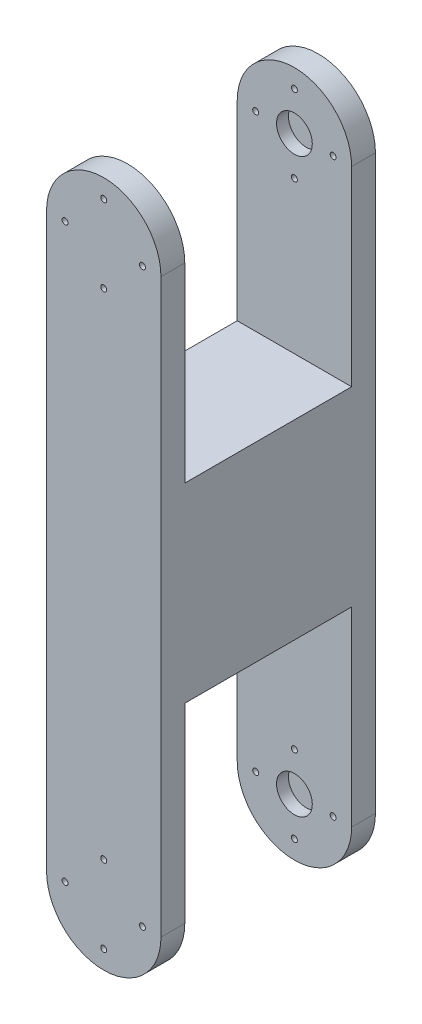
ISO-10303-21;
HEADER;
FILE_DESCRIPTION(('STEP AP214'),'2;1');
FILE_NAME('part.step','',(''),(''),'','','');
FILE_SCHEMA(('AUTOMOTIVE_DESIGN { 1 0 10303 214 1 1 1 1 }'));
ENDSEC;
DATA;
#1=APPLICATION_CONTEXT('core data for automotive mechanical design processes');
#2=APPLICATION_PROTOCOL_DEFINITION('international standard','automotive_design',2000,#1);
#3=PRODUCT_CONTEXT('',#1,'mechanical');
#4=PRODUCT('Part','Part','',(#3));
#5=PRODUCT_RELATED_PRODUCT_CATEGORY('part','',(#4));
#6=PRODUCT_DEFINITION_FORMATION('','',#4);
#7=PRODUCT_DEFINITION_CONTEXT('part definition',#1,'design');
#8=PRODUCT_DEFINITION('design','',#6,#7);
#9=PRODUCT_DEFINITION_SHAPE('','',#8);
#10=(LENGTH_UNIT() NAMED_UNIT(*) SI_UNIT(.MILLI.,.METRE.));
#11=(NAMED_UNIT(*) PLANE_ANGLE_UNIT() SI_UNIT($,.RADIAN.));
#12=(NAMED_UNIT(*) SI_UNIT($,.STERADIAN.) SOLID_ANGLE_UNIT());
#13=UNCERTAINTY_MEASURE_WITH_UNIT(LENGTH_MEASURE(1.E-05),#10,'distance_accuracy_value','');
#14=(GEOMETRIC_REPRESENTATION_CONTEXT(3) GLOBAL_UNCERTAINTY_ASSIGNED_CONTEXT((#13)) GLOBAL_UNIT_ASSIGNED_CONTEXT((#10,
#11,#12)) REPRESENTATION_CONTEXT('',''));
#15=CARTESIAN_POINT('',(0.,0.,0.));
#16=DIRECTION('',(0.,0.,1.));
#17=DIRECTION('',(1.,0.,0.));
#18=AXIS2_PLACEMENT_3D('',#15,#16,#17);
#19=CARTESIAN_POINT('',(-15.24,76.2,57.15));
#20=DIRECTION('',(1.,0.,0.));
#21=DIRECTION('',(0.,0.,-1.));
#22=AXIS2_PLACEMENT_3D('',#19,#20,#21);
#23=PLANE('',#22);
#24=DIRECTION('',(0.,1.,0.));
#25=VECTOR('',#24,1.);
#26=CARTESIAN_POINT('',(-15.24,76.2,50.8));
#27=LINE('',#26,#25);
#28=CARTESIAN_POINT('',(-15.2399999999999,-76.2,50.8));
#29=VERTEX_POINT('',#28);
#30=CARTESIAN_POINT('',(-15.24,-25.3999999999999,50.8));
#31=VERTEX_POINT('',#30);
#32=EDGE_CURVE('E156',#29,#31,#27,.T.);
#33=ORIENTED_EDGE('',*,*,#32,.F.);
#34=DIRECTION('',(0.,0.,-1.));
#35=VECTOR('',#34,1.);
#36=CARTESIAN_POINT('',(-15.24,-76.2,57.15));
#37=LINE('',#36,#35);
#38=CARTESIAN_POINT('',(-15.24,-76.2,57.15));
#39=VERTEX_POINT('',#38);
#40=EDGE_CURVE('E260',#39,#29,#37,.T.);
#41=ORIENTED_EDGE('',*,*,#40,.F.);
#42=DIRECTION('',(0.,-1.,0.));
#43=VECTOR('',#42,1.);
#44=CARTESIAN_POINT('',(-15.24,76.2,57.15));
#45=LINE('',#44,#43);
#46=CARTESIAN_POINT('',(-15.24,76.2,57.15));
#47=VERTEX_POINT('',#46);
#48=EDGE_CURVE('E235',#47,#39,#45,.T.);
#49=ORIENTED_EDGE('',*,*,#48,.F.);
#50=DIRECTION('',(0.,0.,-1.));
#51=VECTOR('',#50,1.);
#52=CARTESIAN_POINT('',(-15.24,76.2,57.15));
#53=LINE('',#52,#51);
#54=CARTESIAN_POINT('',(-15.24,76.2,50.8));
#55=VERTEX_POINT('',#54);
#56=EDGE_CURVE('E264',#47,#55,#53,.T.);
#57=ORIENTED_EDGE('',*,*,#56,.T.);
#58=DIRECTION('',(0.,-1.,0.));
#59=VECTOR('',#58,1.);
#60=CARTESIAN_POINT('',(-15.24,76.2,50.8));
#61=LINE('',#60,#59);
#62=CARTESIAN_POINT('',(-15.24,25.3999999999999,50.8));
#63=VERTEX_POINT('',#62);
#64=EDGE_CURVE('E226',#55,#63,#61,.T.);
#65=ORIENTED_EDGE('',*,*,#64,.T.);
#66=DIRECTION('',(0.,0.,-1.));
#67=VECTOR('',#66,1.);
#68=CARTESIAN_POINT('',(-15.24,25.3999999999999,57.15));
#69=LINE('',#68,#67);
#70=CARTESIAN_POINT('',(-15.24,25.3999999999999,6.34999999999999));
#71=VERTEX_POINT('',#70);
#72=EDGE_CURVE('E217',#63,#71,#69,.T.);
#73=ORIENTED_EDGE('',*,*,#72,.T.);
#74=DIRECTION('',(0.,1.,0.));
#75=VECTOR('',#74,1.);
#76=CARTESIAN_POINT('',(-15.24,76.2,6.35));
#77=LINE('',#76,#75);
#78=CARTESIAN_POINT('',(-15.24,76.2,6.35));
#79=VERTEX_POINT('',#78);
#80=EDGE_CURVE('E221',#71,#79,#77,.T.);
#81=ORIENTED_EDGE('',*,*,#80,.T.);
#82=CARTESIAN_POINT('',(-15.24,76.2,0.));
#83=VERTEX_POINT('',#82);
#84=EDGE_CURVE('E263',#79,#83,#53,.T.);
#85=ORIENTED_EDGE('',*,*,#84,.T.);
#86=DIRECTION('',(0.,-1.,0.));
#87=VECTOR('',#86,1.);
#88=CARTESIAN_POINT('',(-15.24,76.2,0.));
#89=LINE('',#88,#87);
#90=CARTESIAN_POINT('',(-15.24,-76.2,0.));
#91=VERTEX_POINT('',#90);
#92=EDGE_CURVE('E245',#83,#91,#89,.T.);
#93=ORIENTED_EDGE('',*,*,#92,.T.);
#94=CARTESIAN_POINT('',(-15.2399999999999,-76.2,6.35));
#95=VERTEX_POINT('',#94);
#96=EDGE_CURVE('E259',#95,#91,#37,.T.);
#97=ORIENTED_EDGE('',*,*,#96,.F.);
#98=DIRECTION('',(0.,-1.,0.));
#99=VECTOR('',#98,1.);
#100=CARTESIAN_POINT('',(-15.24,76.2,6.34999999999998));
#101=LINE('',#100,#99);
#102=CARTESIAN_POINT('',(-15.24,-25.3999999999999,6.34999999999999));
#103=VERTEX_POINT('',#102);
#104=EDGE_CURVE('E151',#103,#95,#101,.T.);
#105=ORIENTED_EDGE('',*,*,#104,.F.);
#106=DIRECTION('',(0.,0.,-1.));
#107=VECTOR('',#106,1.);
#108=CARTESIAN_POINT('',(-15.24,-25.3999999999999,57.15));
#109=LINE('',#108,#107);
#110=EDGE_CURVE('E134',#31,#103,#109,.T.);
#111=ORIENTED_EDGE('',*,*,#110,.F.);
#112=EDGE_LOOP('',(#33,#41,#49,#57,#65,#73,#81,#85,#93,#97,#105,#111));
#113=FACE_BOUND('',#112,.T.);
#114=ADVANCED_FACE('F34',(#113),#23,.F.);
#115=CARTESIAN_POINT('',(0.,-76.2,57.15));
#116=DIRECTION('',(0.,0.,-1.));
#117=DIRECTION('',(-1.,0.,0.));
#118=AXIS2_PLACEMENT_3D('',#115,#116,#117);
#119=CYLINDRICAL_SURFACE('',#118,15.2399999999999);
#120=CARTESIAN_POINT('',(0.,-76.2,50.8));
#121=DIRECTION('',(0.,0.,-1.));
#122=DIRECTION('',(0.,1.,0.));
#123=AXIS2_PLACEMENT_3D('',#120,#121,#122);
#124=CIRCLE('',#123,15.2399999999999);
#125=CARTESIAN_POINT('',(15.2399999999999,-76.2,50.8));
#126=VERTEX_POINT('',#125);
#127=EDGE_CURVE('E154',#126,#29,#124,.T.);
#128=ORIENTED_EDGE('',*,*,#127,.F.);
#129=DIRECTION('',(0.,0.,-1.));
#130=VECTOR('',#129,1.);
#131=CARTESIAN_POINT('',(15.24,-76.2,57.15));
#132=LINE('',#131,#130);
#133=CARTESIAN_POINT('',(15.24,-76.2,57.15));
#134=VERTEX_POINT('',#133);
#135=EDGE_CURVE('E257',#134,#126,#132,.T.);
#136=ORIENTED_EDGE('',*,*,#135,.F.);
#137=CARTESIAN_POINT('',(0.,-76.2,57.15));
#138=DIRECTION('',(0.,0.,1.));
#139=DIRECTION('',(1.,0.,0.));
#140=AXIS2_PLACEMENT_3D('',#137,#138,#139);
#141=CIRCLE('',#140,15.2399999999999);
#142=EDGE_CURVE('E238',#39,#134,#141,.T.);
#143=ORIENTED_EDGE('',*,*,#142,.F.);
#144=ORIENTED_EDGE('',*,*,#40,.T.);
#145=EDGE_LOOP('',(#128,#136,#143,#144));
#146=FACE_BOUND('',#145,.T.);
#147=ADVANCED_FACE('F324',(#146),#119,.T.);
#148=CARTESIAN_POINT('',(15.24,-76.2,6.34999999999999));
#149=VERTEX_POINT('',#148);
#150=CARTESIAN_POINT('',(15.24,-76.2,0.));
#151=VERTEX_POINT('',#150);
#152=EDGE_CURVE('E256',#149,#151,#132,.T.);
#153=ORIENTED_EDGE('',*,*,#152,.F.);
#154=CARTESIAN_POINT('',(0.,-76.2,6.35));
#155=DIRECTION('',(0.,0.,1.));
#156=DIRECTION('',(0.,-1.,0.));
#157=AXIS2_PLACEMENT_3D('',#154,#155,#156);
#158=CIRCLE('',#157,15.2399999999999);
#159=EDGE_CURVE('E51',#95,#149,#158,.T.);
#160=ORIENTED_EDGE('',*,*,#159,.F.);
#161=ORIENTED_EDGE('',*,*,#96,.T.);
#162=CARTESIAN_POINT('',(0.,-76.2,0.));
#163=DIRECTION('',(0.,0.,1.));
#164=DIRECTION('',(1.,0.,0.));
#165=AXIS2_PLACEMENT_3D('',#162,#163,#164);
#166=CIRCLE('',#165,15.2399999999999);
#167=EDGE_CURVE('E248',#91,#151,#166,.T.);
#168=ORIENTED_EDGE('',*,*,#167,.T.);
#169=EDGE_LOOP('',(#153,#160,#161,#168));
#170=FACE_BOUND('',#169,.T.);
#171=ADVANCED_FACE('F329',(#170),#119,.T.);
#172=CARTESIAN_POINT('',(15.2399999999999,76.2,57.15));
#173=DIRECTION('',(-1.,0.,0.));
#174=DIRECTION('',(0.,-1.,0.));
#175=AXIS2_PLACEMENT_3D('',#172,#173,#174);
#176=PLANE('',#175);
#177=DIRECTION('',(0.,-1.,0.));
#178=VECTOR('',#177,1.);
#179=CARTESIAN_POINT('',(15.2399999999999,76.2,50.8));
#180=LINE('',#179,#178);
#181=CARTESIAN_POINT('',(15.2399999999999,-25.3999999999999,50.8));
#182=VERTEX_POINT('',#181);
#183=EDGE_CURVE('E11',#182,#126,#180,.T.);
#184=ORIENTED_EDGE('',*,*,#183,.F.);
#185=DIRECTION('',(0.,0.,-1.));
#186=VECTOR('',#185,1.);
#187=CARTESIAN_POINT('',(15.2399999999999,-25.3999999999999,50.8));
#188=LINE('',#187,#186);
#189=CARTESIAN_POINT('',(15.2399999999999,-25.3999999999999,6.34999999999999));
#190=VERTEX_POINT('',#189);
#191=EDGE_CURVE('E131',#182,#190,#188,.T.);
#192=ORIENTED_EDGE('',*,*,#191,.T.);
#193=DIRECTION('',(0.,-1.,0.));
#194=VECTOR('',#193,1.);
#195=CARTESIAN_POINT('',(15.2399999999999,-91.4399999999999,6.35));
#196=LINE('',#195,#194);
#197=EDGE_CURVE('E138',#190,#149,#196,.T.);
#198=ORIENTED_EDGE('',*,*,#197,.T.);
#199=ORIENTED_EDGE('',*,*,#152,.T.);
#200=DIRECTION('',(0.,1.,0.));
#201=VECTOR('',#200,1.);
#202=CARTESIAN_POINT('',(15.2399999999999,76.2,0.));
#203=LINE('',#202,#201);
#204=CARTESIAN_POINT('',(15.2399999999999,76.2,0.));
#205=VERTEX_POINT('',#204);
#206=EDGE_CURVE('E236',#151,#205,#203,.T.);
#207=ORIENTED_EDGE('',*,*,#206,.T.);
#208=DIRECTION('',(0.,0.,-1.));
#209=VECTOR('',#208,1.);
#210=CARTESIAN_POINT('',(15.2399999999999,76.2,57.15));
#211=LINE('',#210,#209);
#212=CARTESIAN_POINT('',(15.2399999999999,76.2,6.35));
#213=VERTEX_POINT('',#212);
#214=EDGE_CURVE('E242',#213,#205,#211,.T.);
#215=ORIENTED_EDGE('',*,*,#214,.F.);
#216=DIRECTION('',(0.,1.,0.));
#217=VECTOR('',#216,1.);
#218=CARTESIAN_POINT('',(15.2399999999999,91.4399999999999,6.35));
#219=LINE('',#218,#217);
#220=CARTESIAN_POINT('',(15.2399999999999,25.3999999999999,6.34999999999999));
#221=VERTEX_POINT('',#220);
#222=EDGE_CURVE('E212',#221,#213,#219,.T.);
#223=ORIENTED_EDGE('',*,*,#222,.F.);
#224=DIRECTION('',(0.,0.,-1.));
#225=VECTOR('',#224,1.);
#226=CARTESIAN_POINT('',(15.2399999999999,25.3999999999999,50.8));
#227=LINE('',#226,#225);
#228=CARTESIAN_POINT('',(15.2399999999999,25.3999999999999,50.8));
#229=VERTEX_POINT('',#228);
#230=EDGE_CURVE('E208',#229,#221,#227,.T.);
#231=ORIENTED_EDGE('',*,*,#230,.F.);
#232=DIRECTION('',(0.,1.,0.));
#233=VECTOR('',#232,1.);
#234=CARTESIAN_POINT('',(15.2399999999999,76.2,50.8));
#235=LINE('',#234,#233);
#236=CARTESIAN_POINT('',(15.2399999999999,76.2,50.8));
#237=VERTEX_POINT('',#236);
#238=EDGE_CURVE('E43',#229,#237,#235,.T.);
#239=ORIENTED_EDGE('',*,*,#238,.T.);
#240=CARTESIAN_POINT('',(15.2399999999999,76.2,57.15));
#241=VERTEX_POINT('',#240);
#242=EDGE_CURVE('E253',#241,#237,#211,.T.);
#243=ORIENTED_EDGE('',*,*,#242,.F.);
#244=DIRECTION('',(0.,1.,0.));
#245=VECTOR('',#244,1.);
#246=CARTESIAN_POINT('',(15.2399999999999,76.2,57.15));
#247=LINE('',#246,#245);
#248=EDGE_CURVE('E240',#134,#241,#247,.T.);
#249=ORIENTED_EDGE('',*,*,#248,.F.);
#250=ORIENTED_EDGE('',*,*,#135,.T.);
#251=EDGE_LOOP('',(#184,#192,#198,#199,#207,#215,#223,#231,#239,#243,#249,#250));
#252=FACE_BOUND('',#251,.T.);
#253=ADVANCED_FACE('F144',(#252),#176,.F.);
#254=CARTESIAN_POINT('',(0.,76.2,57.15));
#255=DIRECTION('',(0.,0.,-1.));
#256=DIRECTION('',(-1.,0.,0.));
#257=AXIS2_PLACEMENT_3D('',#254,#255,#256);
#258=CYLINDRICAL_SURFACE('',#257,15.2399999999999);
#259=ORIENTED_EDGE('',*,*,#242,.T.);
#260=CARTESIAN_POINT('',(0.,76.2,50.8));
#261=DIRECTION('',(0.,0.,1.));
#262=DIRECTION('',(0.,-1.,0.));
#263=AXIS2_PLACEMENT_3D('',#260,#261,#262);
#264=CIRCLE('',#263,15.2399999999999);
#265=EDGE_CURVE('E229',#237,#55,#264,.T.);
#266=ORIENTED_EDGE('',*,*,#265,.T.);
#267=ORIENTED_EDGE('',*,*,#56,.F.);
#268=CARTESIAN_POINT('',(0.,76.2,57.15));
#269=DIRECTION('',(0.,0.,1.));
#270=DIRECTION('',(-1.,0.,0.));
#271=AXIS2_PLACEMENT_3D('',#268,#269,#270);
#272=CIRCLE('',#271,15.2399999999999);
#273=EDGE_CURVE('E232',#241,#47,#272,.T.);
#274=ORIENTED_EDGE('',*,*,#273,.F.);
#275=EDGE_LOOP('',(#259,#266,#267,#274));
#276=FACE_BOUND('',#275,.T.);
#277=ADVANCED_FACE('F336',(#276),#258,.T.);
#278=CARTESIAN_POINT('',(0.,76.2,6.35));
#279=DIRECTION('',(0.,0.,-1.));
#280=DIRECTION('',(0.,1.,0.));
#281=AXIS2_PLACEMENT_3D('',#278,#279,#280);
#282=CIRCLE('',#281,15.2399999999999);
#283=EDGE_CURVE('E224',#79,#213,#282,.T.);
#284=ORIENTED_EDGE('',*,*,#283,.T.);
#285=ORIENTED_EDGE('',*,*,#214,.T.);
#286=CARTESIAN_POINT('',(0.,76.2,0.));
#287=DIRECTION('',(0.,0.,1.));
#288=DIRECTION('',(-1.,0.,0.));
#289=AXIS2_PLACEMENT_3D('',#286,#287,#288);
#290=CIRCLE('',#289,15.2399999999999);
#291=EDGE_CURVE('E231',#205,#83,#290,.T.);
#292=ORIENTED_EDGE('',*,*,#291,.T.);
#293=ORIENTED_EDGE('',*,*,#84,.F.);
#294=EDGE_LOOP('',(#284,#285,#292,#293));
#295=FACE_BOUND('',#294,.T.);
#296=ADVANCED_FACE('F36',(#295),#258,.T.);
#297=CARTESIAN_POINT('',(0.,76.2,57.15));
#298=DIRECTION('',(0.,0.,-1.));
#299=DIRECTION('',(-1.,0.,0.));
#300=AXIS2_PLACEMENT_3D('',#297,#298,#299);
#301=PLANE('',#300);
#302=CARTESIAN_POINT('',(0.,-65.88125,57.15));
#303=DIRECTION('',(0.,0.,1.));
#304=DIRECTION('',(-1.,0.,0.));
#305=AXIS2_PLACEMENT_3D('',#302,#303,#304);
#306=CIRCLE('',#305,0.793749999999999);
#307=CARTESIAN_POINT('',(-0.793749999999999,-65.88125,57.15));
#308=VERTEX_POINT('',#307);
#309=EDGE_CURVE('E281',#308,#308,#306,.T.);
#310=ORIENTED_EDGE('',*,*,#309,.F.);
#311=EDGE_LOOP('',(#310));
#312=FACE_BOUND('',#311,.T.);
#313=CARTESIAN_POINT('',(10.31875,-76.2,57.15));
#314=DIRECTION('',(0.,0.,1.));
#315=DIRECTION('',(-1.,0.,0.));
#316=AXIS2_PLACEMENT_3D('',#313,#314,#315);
#317=CIRCLE('',#316,0.793749999999993);
#318=CARTESIAN_POINT('',(9.52500000000001,-76.2,57.15));
#319=VERTEX_POINT('',#318);
#320=EDGE_CURVE('E500',#319,#319,#317,.T.);
#321=ORIENTED_EDGE('',*,*,#320,.F.);
#322=EDGE_LOOP('',(#321));
#323=FACE_BOUND('',#322,.T.);
#324=CARTESIAN_POINT('',(0.,-86.51875,57.15));
#325=DIRECTION('',(0.,0.,1.));
#326=DIRECTION('',(-1.,0.,0.));
#327=AXIS2_PLACEMENT_3D('',#324,#325,#326);
#328=CIRCLE('',#327,0.79375);
#329=CARTESIAN_POINT('',(-0.793749999999998,-86.51875,57.15));
#330=VERTEX_POINT('',#329);
#331=EDGE_CURVE('E508',#330,#330,#328,.T.);
#332=ORIENTED_EDGE('',*,*,#331,.F.);
#333=EDGE_LOOP('',(#332));
#334=FACE_BOUND('',#333,.T.);
#335=CARTESIAN_POINT('',(-10.31875,-76.1999999999999,57.15));
#336=DIRECTION('',(0.,0.,1.));
#337=DIRECTION('',(-1.,0.,0.));
#338=AXIS2_PLACEMENT_3D('',#335,#336,#337);
#339=CIRCLE('',#338,0.793750000000001);
#340=CARTESIAN_POINT('',(-11.1125,-76.1999999999999,57.15));
#341=VERTEX_POINT('',#340);
#342=EDGE_CURVE('E514',#341,#341,#339,.T.);
#343=ORIENTED_EDGE('',*,*,#342,.F.);
#344=EDGE_LOOP('',(#343));
#345=FACE_BOUND('',#344,.T.);
#346=CARTESIAN_POINT('',(0.,65.88125,57.15));
#347=DIRECTION('',(0.,0.,-1.));
#348=DIRECTION('',(-1.,0.,0.));
#349=AXIS2_PLACEMENT_3D('',#346,#347,#348);
#350=CIRCLE('',#349,0.793749999999999);
#351=CARTESIAN_POINT('',(-0.793749999999999,65.88125,57.15));
#352=VERTEX_POINT('',#351);
#353=EDGE_CURVE('E159',#352,#352,#350,.T.);
#354=ORIENTED_EDGE('',*,*,#353,.T.);
#355=EDGE_LOOP('',(#354));
#356=FACE_BOUND('',#355,.T.);
#357=CARTESIAN_POINT('',(10.31875,76.2,57.15));
#358=DIRECTION('',(0.,0.,-1.));
#359=DIRECTION('',(-1.,0.,0.));
#360=AXIS2_PLACEMENT_3D('',#357,#358,#359);
#361=CIRCLE('',#360,0.793749999999993);
#362=CARTESIAN_POINT('',(9.52500000000001,76.2,57.15));
#363=VERTEX_POINT('',#362);
#364=EDGE_CURVE('E166',#363,#363,#361,.T.);
#365=ORIENTED_EDGE('',*,*,#364,.T.);
#366=EDGE_LOOP('',(#365));
#367=FACE_BOUND('',#366,.T.);
#368=CARTESIAN_POINT('',(0.,86.51875,57.15));
#369=DIRECTION('',(0.,0.,-1.));
#370=DIRECTION('',(-1.,0.,0.));
#371=AXIS2_PLACEMENT_3D('',#368,#369,#370);
#372=CIRCLE('',#371,0.79375);
#373=CARTESIAN_POINT('',(-0.793749999999998,86.51875,57.15));
#374=VERTEX_POINT('',#373);
#375=EDGE_CURVE('E172',#374,#374,#372,.T.);
#376=ORIENTED_EDGE('',*,*,#375,.T.);
#377=EDGE_LOOP('',(#376));
#378=FACE_BOUND('',#377,.T.);
#379=CARTESIAN_POINT('',(-10.31875,76.1999999999999,57.15));
#380=DIRECTION('',(0.,0.,-1.));
#381=DIRECTION('',(-1.,0.,0.));
#382=AXIS2_PLACEMENT_3D('',#379,#380,#381);
#383=CIRCLE('',#382,0.793750000000001);
#384=CARTESIAN_POINT('',(-11.1125,76.1999999999999,57.15));
#385=VERTEX_POINT('',#384);
#386=EDGE_CURVE('E178',#385,#385,#383,.T.);
#387=ORIENTED_EDGE('',*,*,#386,.T.);
#388=EDGE_LOOP('',(#387));
#389=FACE_BOUND('',#388,.T.);
#390=ORIENTED_EDGE('',*,*,#273,.T.);
#391=ORIENTED_EDGE('',*,*,#48,.T.);
#392=ORIENTED_EDGE('',*,*,#142,.T.);
#393=ORIENTED_EDGE('',*,*,#248,.T.);
#394=EDGE_LOOP('',(#390,#391,#392,#393));
#395=FACE_BOUND('',#394,.T.);
#396=ADVANCED_FACE('F341',(#312,#323,#334,#345,#356,#367,#378,#389,#395),#301,.F.);
#397=CARTESIAN_POINT('',(0.,76.2,0.));
#398=DIRECTION('',(0.,0.,-1.));
#399=DIRECTION('',(-1.,0.,0.));
#400=AXIS2_PLACEMENT_3D('',#397,#398,#399);
#401=PLANE('',#400);
#402=CARTESIAN_POINT('',(0.,-65.88125,0.));
#403=DIRECTION('',(0.,0.,1.));
#404=DIRECTION('',(-1.,0.,0.));
#405=AXIS2_PLACEMENT_3D('',#402,#403,#404);
#406=CIRCLE('',#405,0.793749999999999);
#407=CARTESIAN_POINT('',(-0.793749999999999,-65.88125,0.));
#408=VERTEX_POINT('',#407);
#409=EDGE_CURVE('E497',#408,#408,#406,.T.);
#410=ORIENTED_EDGE('',*,*,#409,.T.);
#411=EDGE_LOOP('',(#410));
#412=FACE_BOUND('',#411,.T.);
#413=CARTESIAN_POINT('',(10.31875,-76.2,0.));
#414=DIRECTION('',(0.,0.,1.));
#415=DIRECTION('',(-1.,0.,0.));
#416=AXIS2_PLACEMENT_3D('',#413,#414,#415);
#417=CIRCLE('',#416,0.793749999999993);
#418=CARTESIAN_POINT('',(9.52500000000001,-76.2,0.));
#419=VERTEX_POINT('',#418);
#420=EDGE_CURVE('E505',#419,#419,#417,.T.);
#421=ORIENTED_EDGE('',*,*,#420,.T.);
#422=EDGE_LOOP('',(#421));
#423=FACE_BOUND('',#422,.T.);
#424=CARTESIAN_POINT('',(0.,-86.51875,0.));
#425=DIRECTION('',(0.,0.,1.));
#426=DIRECTION('',(-1.,0.,0.));
#427=AXIS2_PLACEMENT_3D('',#424,#425,#426);
#428=CIRCLE('',#427,0.79375);
#429=CARTESIAN_POINT('',(-0.793749999999998,-86.51875,0.));
#430=VERTEX_POINT('',#429);
#431=EDGE_CURVE('E511',#430,#430,#428,.T.);
#432=ORIENTED_EDGE('',*,*,#431,.T.);
#433=EDGE_LOOP('',(#432));
#434=FACE_BOUND('',#433,.T.);
#435=CARTESIAN_POINT('',(-10.31875,-76.1999999999999,0.));
#436=DIRECTION('',(0.,0.,1.));
#437=DIRECTION('',(-1.,0.,0.));
#438=AXIS2_PLACEMENT_3D('',#435,#436,#437);
#439=CIRCLE('',#438,0.793750000000001);
#440=CARTESIAN_POINT('',(-11.1125,-76.1999999999999,0.));
#441=VERTEX_POINT('',#440);
#442=EDGE_CURVE('E516',#441,#441,#439,.T.);
#443=ORIENTED_EDGE('',*,*,#442,.T.);
#444=EDGE_LOOP('',(#443));
#445=FACE_BOUND('',#444,.T.);
#446=CARTESIAN_POINT('',(0.,65.88125,0.));
#447=DIRECTION('',(0.,0.,-1.));
#448=DIRECTION('',(-1.,0.,0.));
#449=AXIS2_PLACEMENT_3D('',#446,#447,#448);
#450=CIRCLE('',#449,0.793749999999999);
#451=CARTESIAN_POINT('',(-0.793749999999999,65.88125,0.));
#452=VERTEX_POINT('',#451);
#453=EDGE_CURVE('E163',#452,#452,#450,.T.);
#454=ORIENTED_EDGE('',*,*,#453,.F.);
#455=EDGE_LOOP('',(#454));
#456=FACE_BOUND('',#455,.T.);
#457=CARTESIAN_POINT('',(10.31875,76.2,0.));
#458=DIRECTION('',(0.,0.,-1.));
#459=DIRECTION('',(-1.,0.,0.));
#460=AXIS2_PLACEMENT_3D('',#457,#458,#459);
#461=CIRCLE('',#460,0.793749999999993);
#462=CARTESIAN_POINT('',(9.52500000000001,76.2,0.));
#463=VERTEX_POINT('',#462);
#464=EDGE_CURVE('E169',#463,#463,#461,.T.);
#465=ORIENTED_EDGE('',*,*,#464,.F.);
#466=EDGE_LOOP('',(#465));
#467=FACE_BOUND('',#466,.T.);
#468=CARTESIAN_POINT('',(0.,86.51875,0.));
#469=DIRECTION('',(0.,0.,-1.));
#470=DIRECTION('',(-1.,0.,0.));
#471=AXIS2_PLACEMENT_3D('',#468,#469,#470);
#472=CIRCLE('',#471,0.79375);
#473=CARTESIAN_POINT('',(-0.793749999999998,86.51875,0.));
#474=VERTEX_POINT('',#473);
#475=EDGE_CURVE('E175',#474,#474,#472,.T.);
#476=ORIENTED_EDGE('',*,*,#475,.F.);
#477=EDGE_LOOP('',(#476));
#478=FACE_BOUND('',#477,.T.);
#479=CARTESIAN_POINT('',(-10.31875,76.1999999999999,0.));
#480=DIRECTION('',(0.,0.,-1.));
#481=DIRECTION('',(-1.,0.,0.));
#482=AXIS2_PLACEMENT_3D('',#479,#480,#481);
#483=CIRCLE('',#482,0.793750000000001);
#484=CARTESIAN_POINT('',(-11.1125,76.1999999999999,0.));
#485=VERTEX_POINT('',#484);
#486=EDGE_CURVE('E158',#485,#485,#483,.T.);
#487=ORIENTED_EDGE('',*,*,#486,.F.);
#488=EDGE_LOOP('',(#487));
#489=FACE_BOUND('',#488,.T.);
#490=ORIENTED_EDGE('',*,*,#291,.F.);
#491=ORIENTED_EDGE('',*,*,#206,.F.);
#492=ORIENTED_EDGE('',*,*,#167,.F.);
#493=ORIENTED_EDGE('',*,*,#92,.F.);
#494=EDGE_LOOP('',(#490,#491,#492,#493));
#495=FACE_BOUND('',#494,.T.);
#496=ADVANCED_FACE('F337',(#412,#423,#434,#445,#456,#467,#478,#489,#495),#401,.T.);
#497=CARTESIAN_POINT('',(-41.9100000000001,91.4399999999999,50.8));
#498=DIRECTION('',(0.,0.,1.));
#499=DIRECTION('',(0.,-1.,0.));
#500=AXIS2_PLACEMENT_3D('',#497,#498,#499);
#501=PLANE('',#500);
#502=CARTESIAN_POINT('',(0.,65.88125,50.8));
#503=DIRECTION('',(0.,0.,1.));
#504=DIRECTION('',(0.,-1.,0.));
#505=AXIS2_PLACEMENT_3D('',#502,#503,#504);
#506=CIRCLE('',#505,0.793749999999999);
#507=CARTESIAN_POINT('',(0.,65.0874999999999,50.8));
#508=VERTEX_POINT('',#507);
#509=EDGE_CURVE('E195',#508,#508,#506,.T.);
#510=ORIENTED_EDGE('',*,*,#509,.T.);
#511=EDGE_LOOP('',(#510));
#512=FACE_BOUND('',#511,.T.);
#513=CARTESIAN_POINT('',(10.31875,76.2,50.8));
#514=DIRECTION('',(0.,0.,1.));
#515=DIRECTION('',(0.,-1.,0.));
#516=AXIS2_PLACEMENT_3D('',#513,#514,#515);
#517=CIRCLE('',#516,0.793749999999993);
#518=CARTESIAN_POINT('',(10.31875,75.40625,50.8));
#519=VERTEX_POINT('',#518);
#520=EDGE_CURVE('E191',#519,#519,#517,.T.);
#521=ORIENTED_EDGE('',*,*,#520,.T.);
#522=EDGE_LOOP('',(#521));
#523=FACE_BOUND('',#522,.T.);
#524=CARTESIAN_POINT('',(0.,86.51875,50.8));
#525=DIRECTION('',(0.,0.,1.));
#526=DIRECTION('',(0.,-1.,0.));
#527=AXIS2_PLACEMENT_3D('',#524,#525,#526);
#528=CIRCLE('',#527,0.79375);
#529=CARTESIAN_POINT('',(0.,85.725,50.8));
#530=VERTEX_POINT('',#529);
#531=EDGE_CURVE('E187',#530,#530,#528,.T.);
#532=ORIENTED_EDGE('',*,*,#531,.T.);
#533=EDGE_LOOP('',(#532));
#534=FACE_BOUND('',#533,.T.);
#535=CARTESIAN_POINT('',(-10.31875,76.1999999999999,50.8));
#536=DIRECTION('',(0.,0.,1.));
#537=DIRECTION('',(0.,-1.,0.));
#538=AXIS2_PLACEMENT_3D('',#535,#536,#537);
#539=CIRCLE('',#538,0.793750000000001);
#540=CARTESIAN_POINT('',(-10.31875,75.40625,50.8));
#541=VERTEX_POINT('',#540);
#542=EDGE_CURVE('E183',#541,#541,#539,.T.);
#543=ORIENTED_EDGE('',*,*,#542,.T.);
#544=EDGE_LOOP('',(#543));
#545=FACE_BOUND('',#544,.T.);
#546=CARTESIAN_POINT('',(0.,76.1999999999999,50.8));
#547=DIRECTION('',(0.,0.,1.));
#548=DIRECTION('',(1.,0.,0.));
#549=AXIS2_PLACEMENT_3D('',#546,#547,#548);
#550=CIRCLE('',#549,4.7625);
#551=CARTESIAN_POINT('',(4.7625,76.1999999999999,50.8));
#552=VERTEX_POINT('',#551);
#553=EDGE_CURVE('E198',#552,#552,#550,.T.);
#554=ORIENTED_EDGE('',*,*,#553,.T.);
#555=EDGE_LOOP('',(#554));
#556=FACE_BOUND('',#555,.T.);
#557=ORIENTED_EDGE('',*,*,#238,.F.);
#558=DIRECTION('',(1.,0.,0.));
#559=VECTOR('',#558,1.);
#560=CARTESIAN_POINT('',(-41.9100000000001,25.3999999999999,50.8));
#561=LINE('',#560,#559);
#562=EDGE_CURVE('E59',#63,#229,#561,.T.);
#563=ORIENTED_EDGE('',*,*,#562,.F.);
#564=ORIENTED_EDGE('',*,*,#64,.F.);
#565=ORIENTED_EDGE('',*,*,#265,.F.);
#566=EDGE_LOOP('',(#557,#563,#564,#565));
#567=FACE_BOUND('',#566,.T.);
#568=ADVANCED_FACE('F340',(#512,#523,#534,#545,#556,#567),#501,.F.);
#569=CARTESIAN_POINT('',(-41.9100000000001,91.4399999999999,6.35));
#570=DIRECTION('',(0.,0.,-1.));
#571=DIRECTION('',(0.,1.,0.));
#572=AXIS2_PLACEMENT_3D('',#569,#570,#571);
#573=PLANE('',#572);
#574=CARTESIAN_POINT('',(0.,65.88125,6.35));
#575=DIRECTION('',(0.,0.,-1.));
#576=DIRECTION('',(0.,1.,0.));
#577=AXIS2_PLACEMENT_3D('',#574,#575,#576);
#578=CIRCLE('',#577,0.793749999999999);
#579=CARTESIAN_POINT('',(0.,66.6749999999999,6.35));
#580=VERTEX_POINT('',#579);
#581=EDGE_CURVE('E194',#580,#580,#578,.T.);
#582=ORIENTED_EDGE('',*,*,#581,.T.);
#583=EDGE_LOOP('',(#582));
#584=FACE_BOUND('',#583,.T.);
#585=CARTESIAN_POINT('',(10.31875,76.2,6.35));
#586=DIRECTION('',(0.,0.,-1.));
#587=DIRECTION('',(0.,1.,0.));
#588=AXIS2_PLACEMENT_3D('',#585,#586,#587);
#589=CIRCLE('',#588,0.793749999999993);
#590=CARTESIAN_POINT('',(10.31875,76.99375,6.35));
#591=VERTEX_POINT('',#590);
#592=EDGE_CURVE('E190',#591,#591,#589,.T.);
#593=ORIENTED_EDGE('',*,*,#592,.T.);
#594=EDGE_LOOP('',(#593));
#595=FACE_BOUND('',#594,.T.);
#596=CARTESIAN_POINT('',(0.,86.51875,6.35));
#597=DIRECTION('',(0.,0.,-1.));
#598=DIRECTION('',(0.,1.,0.));
#599=AXIS2_PLACEMENT_3D('',#596,#597,#598);
#600=CIRCLE('',#599,0.79375);
#601=CARTESIAN_POINT('',(0.,87.3125,6.35));
#602=VERTEX_POINT('',#601);
#603=EDGE_CURVE('E186',#602,#602,#600,.T.);
#604=ORIENTED_EDGE('',*,*,#603,.T.);
#605=EDGE_LOOP('',(#604));
#606=FACE_BOUND('',#605,.T.);
#607=CARTESIAN_POINT('',(-10.31875,76.1999999999999,6.35));
#608=DIRECTION('',(0.,0.,-1.));
#609=DIRECTION('',(0.,1.,0.));
#610=AXIS2_PLACEMENT_3D('',#607,#608,#609);
#611=CIRCLE('',#610,0.793750000000001);
#612=CARTESIAN_POINT('',(-10.31875,76.9937499999999,6.35));
#613=VERTEX_POINT('',#612);
#614=EDGE_CURVE('E162',#613,#613,#611,.T.);
#615=ORIENTED_EDGE('',*,*,#614,.T.);
#616=EDGE_LOOP('',(#615));
#617=FACE_BOUND('',#616,.T.);
#618=CARTESIAN_POINT('',(0.,76.1999999999999,6.34999999999999));
#619=DIRECTION('',(0.,0.,1.));
#620=DIRECTION('',(1.,0.,0.));
#621=AXIS2_PLACEMENT_3D('',#618,#619,#620);
#622=CIRCLE('',#621,4.7625);
#623=CARTESIAN_POINT('',(4.7625,76.1999999999999,6.34999999999999));
#624=VERTEX_POINT('',#623);
#625=EDGE_CURVE('E202',#624,#624,#622,.T.);
#626=ORIENTED_EDGE('',*,*,#625,.F.);
#627=EDGE_LOOP('',(#626));
#628=FACE_BOUND('',#627,.T.);
#629=ORIENTED_EDGE('',*,*,#283,.F.);
#630=ORIENTED_EDGE('',*,*,#80,.F.);
#631=DIRECTION('',(1.,0.,0.));
#632=VECTOR('',#631,1.);
#633=CARTESIAN_POINT('',(-41.9100000000001,25.3999999999999,6.34999999999999));
#634=LINE('',#633,#632);
#635=EDGE_CURVE('E215',#71,#221,#634,.T.);
#636=ORIENTED_EDGE('',*,*,#635,.T.);
#637=ORIENTED_EDGE('',*,*,#222,.T.);
#638=EDGE_LOOP('',(#629,#630,#636,#637));
#639=FACE_BOUND('',#638,.T.);
#640=ADVANCED_FACE('F348',(#584,#595,#606,#617,#628,#639),#573,.F.);
#641=CARTESIAN_POINT('',(-41.9100000000001,25.3999999999999,50.8));
#642=DIRECTION('',(0.,-1.,0.));
#643=DIRECTION('',(1.,0.,0.));
#644=AXIS2_PLACEMENT_3D('',#641,#642,#643);
#645=PLANE('',#644);
#646=ORIENTED_EDGE('',*,*,#562,.T.);
#647=ORIENTED_EDGE('',*,*,#230,.T.);
#648=ORIENTED_EDGE('',*,*,#635,.F.);
#649=ORIENTED_EDGE('',*,*,#72,.F.);
#650=EDGE_LOOP('',(#646,#647,#648,#649));
#651=FACE_BOUND('',#650,.T.);
#652=ADVANCED_FACE('F350',(#651),#645,.F.);
#653=CARTESIAN_POINT('',(0.,76.1999999999999,3.17499999999999));
#654=DIRECTION('',(0.,0.,1.));
#655=DIRECTION('',(1.,0.,0.));
#656=AXIS2_PLACEMENT_3D('',#653,#654,#655);
#657=CYLINDRICAL_SURFACE('',#656,4.7625);
#658=CARTESIAN_POINT('',(0.,76.1999999999999,3.17499999999999));
#659=DIRECTION('',(0.,0.,1.));
#660=DIRECTION('',(1.,0.,0.));
#661=AXIS2_PLACEMENT_3D('',#658,#659,#660);
#662=CIRCLE('',#661,4.7625);
#663=CARTESIAN_POINT('',(4.7625,76.1999999999999,3.17499999999999));
#664=VERTEX_POINT('',#663);
#665=EDGE_CURVE('E205',#664,#664,#662,.T.);
#666=ORIENTED_EDGE('',*,*,#665,.F.);
#667=EDGE_LOOP('',(#666));
#668=FACE_BOUND('',#667,.T.);
#669=ORIENTED_EDGE('',*,*,#625,.T.);
#670=EDGE_LOOP('',(#669));
#671=FACE_BOUND('',#670,.T.);
#672=ADVANCED_FACE('F353',(#668,#671),#657,.F.);
#673=CARTESIAN_POINT('',(0.,76.1999999999999,3.17499999999999));
#674=DIRECTION('',(0.,0.,1.));
#675=DIRECTION('',(1.,0.,0.));
#676=AXIS2_PLACEMENT_3D('',#673,#674,#675);
#677=PLANE('',#676);
#678=ORIENTED_EDGE('',*,*,#665,.T.);
#679=EDGE_LOOP('',(#678));
#680=FACE_BOUND('',#679,.T.);
#681=ADVANCED_FACE('F359',(#680),#677,.T.);
#682=CARTESIAN_POINT('',(0.,76.1999999999999,53.975));
#683=DIRECTION('',(0.,0.,-1.));
#684=DIRECTION('',(-1.,0.,0.));
#685=AXIS2_PLACEMENT_3D('',#682,#683,#684);
#686=CYLINDRICAL_SURFACE('',#685,4.7625);
#687=CARTESIAN_POINT('',(0.,76.1999999999999,53.975));
#688=DIRECTION('',(0.,0.,1.));
#689=DIRECTION('',(1.,0.,0.));
#690=AXIS2_PLACEMENT_3D('',#687,#688,#689);
#691=CIRCLE('',#690,4.7625);
#692=CARTESIAN_POINT('',(4.7625,76.1999999999999,53.975));
#693=VERTEX_POINT('',#692);
#694=EDGE_CURVE('E199',#693,#693,#691,.T.);
#695=ORIENTED_EDGE('',*,*,#694,.T.);
#696=EDGE_LOOP('',(#695));
#697=FACE_BOUND('',#696,.T.);
#698=ORIENTED_EDGE('',*,*,#553,.F.);
#699=EDGE_LOOP('',(#698));
#700=FACE_BOUND('',#699,.T.);
#701=ADVANCED_FACE('F363',(#697,#700),#686,.F.);
#702=CARTESIAN_POINT('',(0.,76.1999999999999,53.975));
#703=DIRECTION('',(0.,0.,-1.));
#704=DIRECTION('',(1.,0.,0.));
#705=AXIS2_PLACEMENT_3D('',#702,#703,#704);
#706=PLANE('',#705);
#707=ORIENTED_EDGE('',*,*,#694,.F.);
#708=EDGE_LOOP('',(#707));
#709=FACE_BOUND('',#708,.T.);
#710=ADVANCED_FACE('F367',(#709),#706,.T.);
#711=CARTESIAN_POINT('',(-10.31875,76.1999999999999,57.15));
#712=DIRECTION('',(0.,0.,-1.));
#713=DIRECTION('',(-1.,0.,0.));
#714=AXIS2_PLACEMENT_3D('',#711,#712,#713);
#715=CYLINDRICAL_SURFACE('',#714,0.793750000000001);
#716=ORIENTED_EDGE('',*,*,#486,.T.);
#717=EDGE_LOOP('',(#716));
#718=FACE_BOUND('',#717,.T.);
#719=ORIENTED_EDGE('',*,*,#614,.F.);
#720=EDGE_LOOP('',(#719));
#721=FACE_BOUND('',#720,.T.);
#722=ADVANCED_FACE('F371',(#718,#721),#715,.F.);
#723=CARTESIAN_POINT('',(0.,86.51875,57.15));
#724=DIRECTION('',(0.,0.,-1.));
#725=DIRECTION('',(-1.,0.,0.));
#726=AXIS2_PLACEMENT_3D('',#723,#724,#725);
#727=CYLINDRICAL_SURFACE('',#726,0.79375);
#728=ORIENTED_EDGE('',*,*,#475,.T.);
#729=EDGE_LOOP('',(#728));
#730=FACE_BOUND('',#729,.T.);
#731=ORIENTED_EDGE('',*,*,#603,.F.);
#732=EDGE_LOOP('',(#731));
#733=FACE_BOUND('',#732,.T.);
#734=ADVANCED_FACE('F383',(#730,#733),#727,.F.);
#735=CARTESIAN_POINT('',(10.31875,76.2,57.15));
#736=DIRECTION('',(0.,0.,-1.));
#737=DIRECTION('',(-1.,0.,0.));
#738=AXIS2_PLACEMENT_3D('',#735,#736,#737);
#739=CYLINDRICAL_SURFACE('',#738,0.793749999999993);
#740=ORIENTED_EDGE('',*,*,#464,.T.);
#741=EDGE_LOOP('',(#740));
#742=FACE_BOUND('',#741,.T.);
#743=ORIENTED_EDGE('',*,*,#592,.F.);
#744=EDGE_LOOP('',(#743));
#745=FACE_BOUND('',#744,.T.);
#746=ADVANCED_FACE('F388',(#742,#745),#739,.F.);
#747=CARTESIAN_POINT('',(0.,65.88125,57.15));
#748=DIRECTION('',(0.,0.,-1.));
#749=DIRECTION('',(-1.,0.,0.));
#750=AXIS2_PLACEMENT_3D('',#747,#748,#749);
#751=CYLINDRICAL_SURFACE('',#750,0.793749999999999);
#752=ORIENTED_EDGE('',*,*,#453,.T.);
#753=EDGE_LOOP('',(#752));
#754=FACE_BOUND('',#753,.T.);
#755=ORIENTED_EDGE('',*,*,#581,.F.);
#756=EDGE_LOOP('',(#755));
#757=FACE_BOUND('',#756,.T.);
#758=ADVANCED_FACE('F377',(#754,#757),#751,.F.);
#759=ORIENTED_EDGE('',*,*,#386,.F.);
#760=EDGE_LOOP('',(#759));
#761=FACE_BOUND('',#760,.T.);
#762=ORIENTED_EDGE('',*,*,#542,.F.);
#763=EDGE_LOOP('',(#762));
#764=FACE_BOUND('',#763,.T.);
#765=ADVANCED_FACE('F373',(#761,#764),#715,.F.);
#766=ORIENTED_EDGE('',*,*,#375,.F.);
#767=EDGE_LOOP('',(#766));
#768=FACE_BOUND('',#767,.T.);
#769=ORIENTED_EDGE('',*,*,#531,.F.);
#770=EDGE_LOOP('',(#769));
#771=FACE_BOUND('',#770,.T.);
#772=ADVANCED_FACE('F376',(#768,#771),#727,.F.);
#773=ORIENTED_EDGE('',*,*,#364,.F.);
#774=EDGE_LOOP('',(#773));
#775=FACE_BOUND('',#774,.T.);
#776=ORIENTED_EDGE('',*,*,#520,.F.);
#777=EDGE_LOOP('',(#776));
#778=FACE_BOUND('',#777,.T.);
#779=ADVANCED_FACE('F381',(#775,#778),#739,.F.);
#780=ORIENTED_EDGE('',*,*,#353,.F.);
#781=EDGE_LOOP('',(#780));
#782=FACE_BOUND('',#781,.T.);
#783=ORIENTED_EDGE('',*,*,#509,.F.);
#784=EDGE_LOOP('',(#783));
#785=FACE_BOUND('',#784,.T.);
#786=ADVANCED_FACE('F386',(#782,#785),#751,.F.);
#787=CARTESIAN_POINT('',(-41.9100000000001,-91.4399999999999,50.8));
#788=DIRECTION('',(0.,0.,-1.));
#789=DIRECTION('',(0.,1.,0.));
#790=AXIS2_PLACEMENT_3D('',#787,#788,#789);
#791=PLANE('',#790);
#792=CARTESIAN_POINT('',(0.,-65.88125,50.8));
#793=DIRECTION('',(0.,0.,-1.));
#794=DIRECTION('',(0.,1.,0.));
#795=AXIS2_PLACEMENT_3D('',#792,#793,#794);
#796=CIRCLE('',#795,0.793749999999999);
#797=CARTESIAN_POINT('',(0.,-65.0874999999999,50.8));
#798=VERTEX_POINT('',#797);
#799=EDGE_CURVE('E299',#798,#798,#796,.F.);
#800=ORIENTED_EDGE('',*,*,#799,.T.);
#801=EDGE_LOOP('',(#800));
#802=FACE_BOUND('',#801,.T.);
#803=CARTESIAN_POINT('',(10.31875,-76.2,50.8));
#804=DIRECTION('',(0.,0.,-1.));
#805=DIRECTION('',(0.,1.,0.));
#806=AXIS2_PLACEMENT_3D('',#803,#804,#805);
#807=CIRCLE('',#806,0.793749999999993);
#808=CARTESIAN_POINT('',(10.31875,-75.40625,50.8));
#809=VERTEX_POINT('',#808);
#810=EDGE_CURVE('E287',#809,#809,#807,.F.);
#811=ORIENTED_EDGE('',*,*,#810,.T.);
#812=EDGE_LOOP('',(#811));
#813=FACE_BOUND('',#812,.T.);
#814=CARTESIAN_POINT('',(0.,-86.51875,50.8));
#815=DIRECTION('',(0.,0.,-1.));
#816=DIRECTION('',(0.,1.,0.));
#817=AXIS2_PLACEMENT_3D('',#814,#815,#816);
#818=CIRCLE('',#817,0.79375);
#819=CARTESIAN_POINT('',(0.,-85.725,50.8));
#820=VERTEX_POINT('',#819);
#821=EDGE_CURVE('E284',#820,#820,#818,.F.);
#822=ORIENTED_EDGE('',*,*,#821,.T.);
#823=EDGE_LOOP('',(#822));
#824=FACE_BOUND('',#823,.T.);
#825=CARTESIAN_POINT('',(-10.31875,-76.1999999999999,50.8));
#826=DIRECTION('',(0.,0.,-1.));
#827=DIRECTION('',(0.,1.,0.));
#828=AXIS2_PLACEMENT_3D('',#825,#826,#827);
#829=CIRCLE('',#828,0.793750000000001);
#830=CARTESIAN_POINT('',(-10.31875,-75.40625,50.8));
#831=VERTEX_POINT('',#830);
#832=EDGE_CURVE('E280',#831,#831,#829,.F.);
#833=ORIENTED_EDGE('',*,*,#832,.T.);
#834=EDGE_LOOP('',(#833));
#835=FACE_BOUND('',#834,.T.);
#836=ORIENTED_EDGE('',*,*,#32,.T.);
#837=DIRECTION('',(1.,0.,0.));
#838=VECTOR('',#837,1.);
#839=CARTESIAN_POINT('',(-41.9100000000001,-25.3999999999999,50.8));
#840=LINE('',#839,#838);
#841=EDGE_CURVE('E136',#31,#182,#840,.T.);
#842=ORIENTED_EDGE('',*,*,#841,.T.);
#843=ORIENTED_EDGE('',*,*,#183,.T.);
#844=ORIENTED_EDGE('',*,*,#127,.T.);
#845=EDGE_LOOP('',(#836,#842,#843,#844));
#846=FACE_BOUND('',#845,.T.);
#847=ADVANCED_FACE('F391',(#802,#813,#824,#835,#846),#791,.T.);
#848=CARTESIAN_POINT('',(-41.9100000000001,-25.3999999999999,50.8));
#849=DIRECTION('',(0.,-1.,0.));
#850=DIRECTION('',(1.,0.,0.));
#851=AXIS2_PLACEMENT_3D('',#848,#849,#850);
#852=PLANE('',#851);
#853=ORIENTED_EDGE('',*,*,#110,.T.);
#854=DIRECTION('',(1.,0.,0.));
#855=VECTOR('',#854,1.);
#856=CARTESIAN_POINT('',(-41.9100000000001,-25.3999999999999,6.34999999999999));
#857=LINE('',#856,#855);
#858=EDGE_CURVE('E127',#103,#190,#857,.T.);
#859=ORIENTED_EDGE('',*,*,#858,.T.);
#860=ORIENTED_EDGE('',*,*,#191,.F.);
#861=ORIENTED_EDGE('',*,*,#841,.F.);
#862=EDGE_LOOP('',(#853,#859,#860,#861));
#863=FACE_BOUND('',#862,.T.);
#864=ADVANCED_FACE('F128',(#863),#852,.T.);
#865=CARTESIAN_POINT('',(-41.9100000000001,-91.4399999999999,6.35));
#866=DIRECTION('',(0.,0.,1.));
#867=DIRECTION('',(0.,-1.,0.));
#868=AXIS2_PLACEMENT_3D('',#865,#866,#867);
#869=PLANE('',#868);
#870=CARTESIAN_POINT('',(0.,-65.88125,6.35));
#871=DIRECTION('',(0.,0.,1.));
#872=DIRECTION('',(0.,-1.,0.));
#873=AXIS2_PLACEMENT_3D('',#870,#871,#872);
#874=CIRCLE('',#873,0.793749999999999);
#875=CARTESIAN_POINT('',(0.,-66.6749999999999,6.35));
#876=VERTEX_POINT('',#875);
#877=EDGE_CURVE('E38',#876,#876,#874,.F.);
#878=ORIENTED_EDGE('',*,*,#877,.T.);
#879=EDGE_LOOP('',(#878));
#880=FACE_BOUND('',#879,.T.);
#881=CARTESIAN_POINT('',(10.31875,-76.2,6.35));
#882=DIRECTION('',(0.,0.,1.));
#883=DIRECTION('',(0.,-1.,0.));
#884=AXIS2_PLACEMENT_3D('',#881,#882,#883);
#885=CIRCLE('',#884,0.793749999999993);
#886=CARTESIAN_POINT('',(10.31875,-76.99375,6.35));
#887=VERTEX_POINT('',#886);
#888=EDGE_CURVE('E285',#887,#887,#885,.F.);
#889=ORIENTED_EDGE('',*,*,#888,.T.);
#890=EDGE_LOOP('',(#889));
#891=FACE_BOUND('',#890,.T.);
#892=CARTESIAN_POINT('',(0.,-86.51875,6.35));
#893=DIRECTION('',(0.,0.,1.));
#894=DIRECTION('',(0.,-1.,0.));
#895=AXIS2_PLACEMENT_3D('',#892,#893,#894);
#896=CIRCLE('',#895,0.79375);
#897=CARTESIAN_POINT('',(0.,-87.3125,6.35));
#898=VERTEX_POINT('',#897);
#899=EDGE_CURVE('E282',#898,#898,#896,.F.);
#900=ORIENTED_EDGE('',*,*,#899,.T.);
#901=EDGE_LOOP('',(#900));
#902=FACE_BOUND('',#901,.T.);
#903=CARTESIAN_POINT('',(-10.31875,-76.1999999999999,6.35));
#904=DIRECTION('',(0.,0.,1.));
#905=DIRECTION('',(0.,-1.,0.));
#906=AXIS2_PLACEMENT_3D('',#903,#904,#905);
#907=CIRCLE('',#906,0.793750000000001);
#908=CARTESIAN_POINT('',(-10.31875,-76.9937499999999,6.35));
#909=VERTEX_POINT('',#908);
#910=EDGE_CURVE('E277',#909,#909,#907,.F.);
#911=ORIENTED_EDGE('',*,*,#910,.T.);
#912=EDGE_LOOP('',(#911));
#913=FACE_BOUND('',#912,.T.);
#914=CARTESIAN_POINT('',(0.,-76.1999999999999,6.34999999999999));
#915=DIRECTION('',(0.,0.,-1.));
#916=DIRECTION('',(1.,0.,0.));
#917=AXIS2_PLACEMENT_3D('',#914,#915,#916);
#918=CIRCLE('',#917,4.7625);
#919=CARTESIAN_POINT('',(4.7625,-76.1999999999999,6.34999999999999));
#920=VERTEX_POINT('',#919);
#921=EDGE_CURVE('E302',#920,#920,#918,.T.);
#922=ORIENTED_EDGE('',*,*,#921,.T.);
#923=EDGE_LOOP('',(#922));
#924=FACE_BOUND('',#923,.T.);
#925=ORIENTED_EDGE('',*,*,#104,.T.);
#926=ORIENTED_EDGE('',*,*,#159,.T.);
#927=ORIENTED_EDGE('',*,*,#197,.F.);
#928=ORIENTED_EDGE('',*,*,#858,.F.);
#929=EDGE_LOOP('',(#925,#926,#927,#928));
#930=FACE_BOUND('',#929,.T.);
#931=ADVANCED_FACE('F139',(#880,#891,#902,#913,#924,#930),#869,.T.);
#932=CARTESIAN_POINT('',(0.,-76.1999999999999,3.17499999999999));
#933=DIRECTION('',(0.,0.,1.));
#934=DIRECTION('',(1.,0.,0.));
#935=AXIS2_PLACEMENT_3D('',#932,#933,#934);
#936=CYLINDRICAL_SURFACE('',#935,4.7625);
#937=CARTESIAN_POINT('',(0.,-76.1999999999999,3.17499999999999));
#938=DIRECTION('',(0.,0.,-1.));
#939=DIRECTION('',(1.,0.,0.));
#940=AXIS2_PLACEMENT_3D('',#937,#938,#939);
#941=CIRCLE('',#940,4.7625);
#942=CARTESIAN_POINT('',(4.7625,-76.1999999999999,3.17499999999999));
#943=VERTEX_POINT('',#942);
#944=EDGE_CURVE('E142',#943,#943,#941,.T.);
#945=ORIENTED_EDGE('',*,*,#944,.T.);
#946=EDGE_LOOP('',(#945));
#947=FACE_BOUND('',#946,.T.);
#948=ORIENTED_EDGE('',*,*,#921,.F.);
#949=EDGE_LOOP('',(#948));
#950=FACE_BOUND('',#949,.T.);
#951=ADVANCED_FACE('F308',(#947,#950),#936,.F.);
#952=CARTESIAN_POINT('',(0.,-76.1999999999999,3.17499999999999));
#953=DIRECTION('',(0.,0.,1.));
#954=DIRECTION('',(1.,0.,0.));
#955=AXIS2_PLACEMENT_3D('',#952,#953,#954);
#956=PLANE('',#955);
#957=ORIENTED_EDGE('',*,*,#944,.F.);
#958=EDGE_LOOP('',(#957));
#959=FACE_BOUND('',#958,.T.);
#960=ADVANCED_FACE('F310',(#959),#956,.T.);
#961=CARTESIAN_POINT('',(-10.31875,-76.1999999999999,57.15));
#962=DIRECTION('',(0.,0.,-1.));
#963=DIRECTION('',(-1.,0.,0.));
#964=AXIS2_PLACEMENT_3D('',#961,#962,#963);
#965=CYLINDRICAL_SURFACE('',#964,0.793750000000001);
#966=ORIENTED_EDGE('',*,*,#910,.F.);
#967=EDGE_LOOP('',(#966));
#968=FACE_BOUND('',#967,.T.);
#969=ORIENTED_EDGE('',*,*,#442,.F.);
#970=EDGE_LOOP('',(#969));
#971=FACE_BOUND('',#970,.T.);
#972=ADVANCED_FACE('F317',(#968,#971),#965,.F.);
#973=CARTESIAN_POINT('',(0.,-86.51875,57.15));
#974=DIRECTION('',(0.,0.,-1.));
#975=DIRECTION('',(-1.,0.,0.));
#976=AXIS2_PLACEMENT_3D('',#973,#974,#975);
#977=CYLINDRICAL_SURFACE('',#976,0.79375);
#978=ORIENTED_EDGE('',*,*,#899,.F.);
#979=EDGE_LOOP('',(#978));
#980=FACE_BOUND('',#979,.T.);
#981=ORIENTED_EDGE('',*,*,#431,.F.);
#982=EDGE_LOOP('',(#981));
#983=FACE_BOUND('',#982,.T.);
#984=ADVANCED_FACE('F423',(#980,#983),#977,.F.);
#985=CARTESIAN_POINT('',(10.31875,-76.2,57.15));
#986=DIRECTION('',(0.,0.,-1.));
#987=DIRECTION('',(-1.,0.,0.));
#988=AXIS2_PLACEMENT_3D('',#985,#986,#987);
#989=CYLINDRICAL_SURFACE('',#988,0.793749999999993);
#990=ORIENTED_EDGE('',*,*,#888,.F.);
#991=EDGE_LOOP('',(#990));
#992=FACE_BOUND('',#991,.T.);
#993=ORIENTED_EDGE('',*,*,#420,.F.);
#994=EDGE_LOOP('',(#993));
#995=FACE_BOUND('',#994,.T.);
#996=ADVANCED_FACE('F434',(#992,#995),#989,.F.);
#997=CARTESIAN_POINT('',(0.,-65.88125,57.15));
#998=DIRECTION('',(0.,0.,-1.));
#999=DIRECTION('',(-1.,0.,0.));
#1000=AXIS2_PLACEMENT_3D('',#997,#998,#999);
#1001=CYLINDRICAL_SURFACE('',#1000,0.793749999999999);
#1002=ORIENTED_EDGE('',*,*,#877,.F.);
#1003=EDGE_LOOP('',(#1002));
#1004=FACE_BOUND('',#1003,.T.);
#1005=ORIENTED_EDGE('',*,*,#409,.F.);
#1006=EDGE_LOOP('',(#1005));
#1007=FACE_BOUND('',#1006,.T.);
#1008=ADVANCED_FACE('F445',(#1004,#1007),#1001,.F.);
#1009=ORIENTED_EDGE('',*,*,#832,.F.);
#1010=EDGE_LOOP('',(#1009));
#1011=FACE_BOUND('',#1010,.T.);
#1012=ORIENTED_EDGE('',*,*,#342,.T.);
#1013=EDGE_LOOP('',(#1012));
#1014=FACE_BOUND('',#1013,.T.);
#1015=ADVANCED_FACE('F426',(#1011,#1014),#965,.F.);
#1016=ORIENTED_EDGE('',*,*,#821,.F.);
#1017=EDGE_LOOP('',(#1016));
#1018=FACE_BOUND('',#1017,.T.);
#1019=ORIENTED_EDGE('',*,*,#331,.T.);
#1020=EDGE_LOOP('',(#1019));
#1021=FACE_BOUND('',#1020,.T.);
#1022=ADVANCED_FACE('F437',(#1018,#1021),#977,.F.);
#1023=ORIENTED_EDGE('',*,*,#810,.F.);
#1024=EDGE_LOOP('',(#1023));
#1025=FACE_BOUND('',#1024,.T.);
#1026=ORIENTED_EDGE('',*,*,#320,.T.);
#1027=EDGE_LOOP('',(#1026));
#1028=FACE_BOUND('',#1027,.T.);
#1029=ADVANCED_FACE('F448',(#1025,#1028),#989,.F.);
#1030=ORIENTED_EDGE('',*,*,#799,.F.);
#1031=EDGE_LOOP('',(#1030));
#1032=FACE_BOUND('',#1031,.T.);
#1033=ORIENTED_EDGE('',*,*,#309,.T.);
#1034=EDGE_LOOP('',(#1033));
#1035=FACE_BOUND('',#1034,.T.);
#1036=ADVANCED_FACE('F458',(#1032,#1035),#1001,.F.);
#1037=CLOSED_SHELL('',(#114,#147,#171,#253,#277,#296,#396,#496,#568,#640,#652,#672,#681,#701,
#710,#722,#734,#746,#758,#765,#772,#779,#786,#847,#864,#931,#951,#960,#972,#984,#996,#1008,
#1015,#1022,#1029,#1036));
#1038=MANIFOLD_SOLID_BREP('B2',#1037);
#1039=ADVANCED_BREP_SHAPE_REPRESENTATION('',(#18,#1038),#14);
#1040=SHAPE_DEFINITION_REPRESENTATION(#9,#1039);
ENDSEC;
END-ISO-10303-21;
